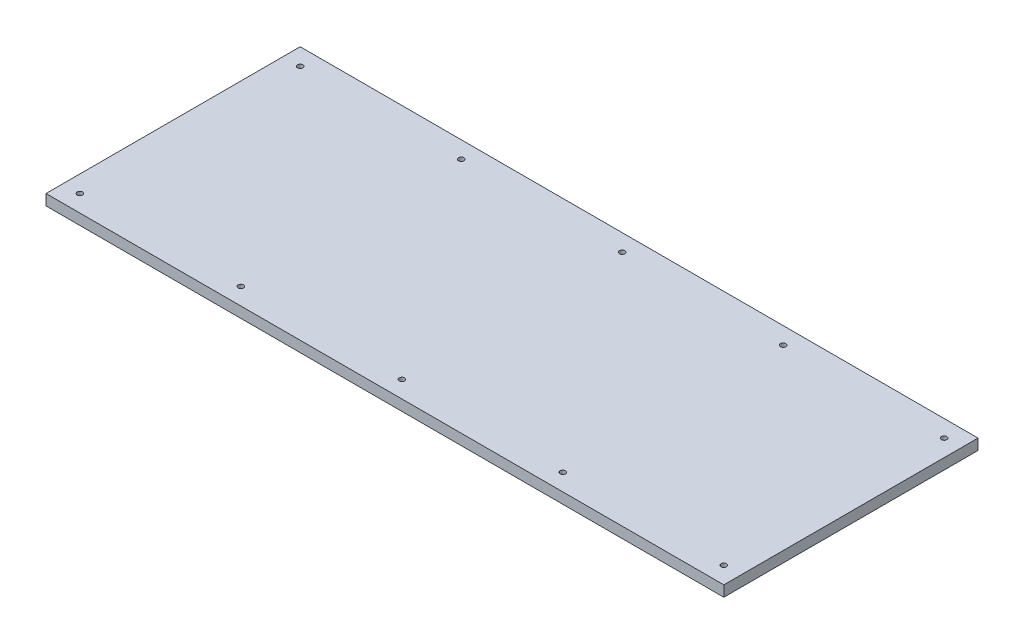
ISO-10303-21;
HEADER;
FILE_DESCRIPTION(('STEP AP214'),'2;1');
FILE_NAME('part.step','',(''),(''),'','','');
FILE_SCHEMA(('AUTOMOTIVE_DESIGN { 1 0 10303 214 1 1 1 1 }'));
ENDSEC;
DATA;
#1=APPLICATION_CONTEXT('core data for automotive mechanical design processes');
#2=APPLICATION_PROTOCOL_DEFINITION('international standard','automotive_design',2000,#1);
#3=PRODUCT_CONTEXT('',#1,'mechanical');
#4=PRODUCT('Part','Part','',(#3));
#5=PRODUCT_RELATED_PRODUCT_CATEGORY('part','',(#4));
#6=PRODUCT_DEFINITION_FORMATION('','',#4);
#7=PRODUCT_DEFINITION_CONTEXT('part definition',#1,'design');
#8=PRODUCT_DEFINITION('design','',#6,#7);
#9=PRODUCT_DEFINITION_SHAPE('','',#8);
#10=(LENGTH_UNIT() NAMED_UNIT(*) SI_UNIT(.MILLI.,.METRE.));
#11=(NAMED_UNIT(*) PLANE_ANGLE_UNIT() SI_UNIT($,.RADIAN.));
#12=(NAMED_UNIT(*) SI_UNIT($,.STERADIAN.) SOLID_ANGLE_UNIT());
#13=UNCERTAINTY_MEASURE_WITH_UNIT(LENGTH_MEASURE(1.E-05),#10,'distance_accuracy_value','');
#14=(GEOMETRIC_REPRESENTATION_CONTEXT(3) GLOBAL_UNCERTAINTY_ASSIGNED_CONTEXT((#13)) GLOBAL_UNIT_ASSIGNED_CONTEXT((#10,
#11,#12)) REPRESENTATION_CONTEXT('',''));
#15=CARTESIAN_POINT('',(0.,0.,0.));
#16=DIRECTION('',(0.,0.,1.));
#17=DIRECTION('',(1.,0.,0.));
#18=AXIS2_PLACEMENT_3D('',#15,#16,#17);
#19=CARTESIAN_POINT('',(190.,-6.35,65.));
#20=DIRECTION('',(0.,-1.,0.));
#21=DIRECTION('',(0.,0.,-1.));
#22=AXIS2_PLACEMENT_3D('',#19,#20,#21);
#23=CYLINDRICAL_SURFACE('',#22,1.59999999999999);
#24=CARTESIAN_POINT('',(190.,0.,65.));
#25=DIRECTION('',(0.,-1.,0.));
#26=DIRECTION('',(0.,0.,-1.));
#27=AXIS2_PLACEMENT_3D('',#24,#25,#26);
#28=CIRCLE('',#27,1.59999999999999);
#29=CARTESIAN_POINT('',(190.,0.,63.4));
#30=VERTEX_POINT('',#29);
#31=EDGE_CURVE('E42',#30,#30,#28,.T.);
#32=ORIENTED_EDGE('',*,*,#31,.F.);
#33=EDGE_LOOP('',(#32));
#34=FACE_BOUND('',#33,.T.);
#35=CARTESIAN_POINT('',(190.,-6.35,65.));
#36=DIRECTION('',(0.,-1.,0.));
#37=DIRECTION('',(0.,0.,-1.));
#38=AXIS2_PLACEMENT_3D('',#35,#36,#37);
#39=CIRCLE('',#38,1.59999999999999);
#40=CARTESIAN_POINT('',(190.,-6.35,63.4));
#41=VERTEX_POINT('',#40);
#42=EDGE_CURVE('E11',#41,#41,#39,.T.);
#43=ORIENTED_EDGE('',*,*,#42,.T.);
#44=EDGE_LOOP('',(#43));
#45=FACE_BOUND('',#44,.T.);
#46=ADVANCED_FACE('F34',(#34,#45),#23,.F.);
#47=CARTESIAN_POINT('',(95.0000000000001,-6.35,65.));
#48=DIRECTION('',(0.,-1.,0.));
#49=DIRECTION('',(0.,0.,-1.));
#50=AXIS2_PLACEMENT_3D('',#47,#48,#49);
#51=CYLINDRICAL_SURFACE('',#50,1.59999999999999);
#52=CARTESIAN_POINT('',(95.0000000000001,0.,65.));
#53=DIRECTION('',(0.,-1.,0.));
#54=DIRECTION('',(0.,0.,-1.));
#55=AXIS2_PLACEMENT_3D('',#52,#53,#54);
#56=CIRCLE('',#55,1.59999999999999);
#57=CARTESIAN_POINT('',(95.0000000000001,0.,63.4));
#58=VERTEX_POINT('',#57);
#59=EDGE_CURVE('E139',#58,#58,#56,.T.);
#60=ORIENTED_EDGE('',*,*,#59,.F.);
#61=EDGE_LOOP('',(#60));
#62=FACE_BOUND('',#61,.T.);
#63=CARTESIAN_POINT('',(95.0000000000001,-6.35,65.));
#64=DIRECTION('',(0.,-1.,0.));
#65=DIRECTION('',(0.,0.,-1.));
#66=AXIS2_PLACEMENT_3D('',#63,#64,#65);
#67=CIRCLE('',#66,1.59999999999999);
#68=CARTESIAN_POINT('',(95.0000000000001,-6.35,63.4));
#69=VERTEX_POINT('',#68);
#70=EDGE_CURVE('E142',#69,#69,#67,.T.);
#71=ORIENTED_EDGE('',*,*,#70,.T.);
#72=EDGE_LOOP('',(#71));
#73=FACE_BOUND('',#72,.T.);
#74=ADVANCED_FACE('F151',(#62,#73),#51,.F.);
#75=CARTESIAN_POINT('',(0.,-6.35,65.));
#76=DIRECTION('',(0.,-1.,0.));
#77=DIRECTION('',(0.,0.,-1.));
#78=AXIS2_PLACEMENT_3D('',#75,#76,#77);
#79=CYLINDRICAL_SURFACE('',#78,1.59999999999999);
#80=CARTESIAN_POINT('',(0.,0.,65.));
#81=DIRECTION('',(0.,-1.,0.));
#82=DIRECTION('',(0.,0.,-1.));
#83=AXIS2_PLACEMENT_3D('',#80,#81,#82);
#84=CIRCLE('',#83,1.59999999999999);
#85=CARTESIAN_POINT('',(0.,0.,63.4));
#86=VERTEX_POINT('',#85);
#87=EDGE_CURVE('E133',#86,#86,#84,.T.);
#88=ORIENTED_EDGE('',*,*,#87,.F.);
#89=EDGE_LOOP('',(#88));
#90=FACE_BOUND('',#89,.T.);
#91=CARTESIAN_POINT('',(0.,-6.35,65.));
#92=DIRECTION('',(0.,-1.,0.));
#93=DIRECTION('',(0.,0.,-1.));
#94=AXIS2_PLACEMENT_3D('',#91,#92,#93);
#95=CIRCLE('',#94,1.59999999999999);
#96=CARTESIAN_POINT('',(0.,-6.35,63.4));
#97=VERTEX_POINT('',#96);
#98=EDGE_CURVE('E136',#97,#97,#95,.T.);
#99=ORIENTED_EDGE('',*,*,#98,.T.);
#100=EDGE_LOOP('',(#99));
#101=FACE_BOUND('',#100,.T.);
#102=ADVANCED_FACE('F189',(#90,#101),#79,.F.);
#103=CARTESIAN_POINT('',(190.,-6.35,-65.));
#104=DIRECTION('',(0.,-1.,0.));
#105=DIRECTION('',(0.,0.,-1.));
#106=AXIS2_PLACEMENT_3D('',#103,#104,#105);
#107=CYLINDRICAL_SURFACE('',#106,1.59999999999999);
#108=CARTESIAN_POINT('',(190.,0.,-65.));
#109=DIRECTION('',(0.,-1.,0.));
#110=DIRECTION('',(0.,0.,-1.));
#111=AXIS2_PLACEMENT_3D('',#108,#109,#110);
#112=CIRCLE('',#111,1.59999999999999);
#113=CARTESIAN_POINT('',(190.,0.,-66.6));
#114=VERTEX_POINT('',#113);
#115=EDGE_CURVE('E127',#114,#114,#112,.T.);
#116=ORIENTED_EDGE('',*,*,#115,.F.);
#117=EDGE_LOOP('',(#116));
#118=FACE_BOUND('',#117,.T.);
#119=CARTESIAN_POINT('',(190.,-6.35,-65.));
#120=DIRECTION('',(0.,-1.,0.));
#121=DIRECTION('',(0.,0.,-1.));
#122=AXIS2_PLACEMENT_3D('',#119,#120,#121);
#123=CIRCLE('',#122,1.59999999999999);
#124=CARTESIAN_POINT('',(190.,-6.35,-66.6));
#125=VERTEX_POINT('',#124);
#126=EDGE_CURVE('E130',#125,#125,#123,.T.);
#127=ORIENTED_EDGE('',*,*,#126,.T.);
#128=EDGE_LOOP('',(#127));
#129=FACE_BOUND('',#128,.T.);
#130=ADVANCED_FACE('F185',(#118,#129),#107,.F.);
#131=CARTESIAN_POINT('',(95.0000000000001,-6.35,-65.));
#132=DIRECTION('',(0.,-1.,0.));
#133=DIRECTION('',(0.,0.,-1.));
#134=AXIS2_PLACEMENT_3D('',#131,#132,#133);
#135=CYLINDRICAL_SURFACE('',#134,1.59999999999999);
#136=CARTESIAN_POINT('',(95.0000000000001,0.,-65.));
#137=DIRECTION('',(0.,-1.,0.));
#138=DIRECTION('',(0.,0.,-1.));
#139=AXIS2_PLACEMENT_3D('',#136,#137,#138);
#140=CIRCLE('',#139,1.59999999999999);
#141=CARTESIAN_POINT('',(95.0000000000001,0.,-66.6));
#142=VERTEX_POINT('',#141);
#143=EDGE_CURVE('E121',#142,#142,#140,.T.);
#144=ORIENTED_EDGE('',*,*,#143,.F.);
#145=EDGE_LOOP('',(#144));
#146=FACE_BOUND('',#145,.T.);
#147=CARTESIAN_POINT('',(95.0000000000001,-6.35,-65.));
#148=DIRECTION('',(0.,-1.,0.));
#149=DIRECTION('',(0.,0.,-1.));
#150=AXIS2_PLACEMENT_3D('',#147,#148,#149);
#151=CIRCLE('',#150,1.59999999999999);
#152=CARTESIAN_POINT('',(95.0000000000001,-6.35,-66.6));
#153=VERTEX_POINT('',#152);
#154=EDGE_CURVE('E124',#153,#153,#151,.T.);
#155=ORIENTED_EDGE('',*,*,#154,.T.);
#156=EDGE_LOOP('',(#155));
#157=FACE_BOUND('',#156,.T.);
#158=ADVANCED_FACE('F181',(#146,#157),#135,.F.);
#159=CARTESIAN_POINT('',(0.,-6.35,-65.));
#160=DIRECTION('',(0.,-1.,0.));
#161=DIRECTION('',(0.,0.,-1.));
#162=AXIS2_PLACEMENT_3D('',#159,#160,#161);
#163=CYLINDRICAL_SURFACE('',#162,1.59999999999999);
#164=CARTESIAN_POINT('',(0.,0.,-65.));
#165=DIRECTION('',(0.,-1.,0.));
#166=DIRECTION('',(0.,0.,-1.));
#167=AXIS2_PLACEMENT_3D('',#164,#165,#166);
#168=CIRCLE('',#167,1.59999999999999);
#169=CARTESIAN_POINT('',(0.,0.,-66.6));
#170=VERTEX_POINT('',#169);
#171=EDGE_CURVE('E113',#170,#170,#168,.T.);
#172=ORIENTED_EDGE('',*,*,#171,.F.);
#173=EDGE_LOOP('',(#172));
#174=FACE_BOUND('',#173,.T.);
#175=CARTESIAN_POINT('',(0.,-6.35,-65.));
#176=DIRECTION('',(0.,-1.,0.));
#177=DIRECTION('',(0.,0.,-1.));
#178=AXIS2_PLACEMENT_3D('',#175,#176,#177);
#179=CIRCLE('',#178,1.59999999999999);
#180=CARTESIAN_POINT('',(0.,-6.35,-66.6));
#181=VERTEX_POINT('',#180);
#182=EDGE_CURVE('E118',#181,#181,#179,.T.);
#183=ORIENTED_EDGE('',*,*,#182,.T.);
#184=EDGE_LOOP('',(#183));
#185=FACE_BOUND('',#184,.T.);
#186=ADVANCED_FACE('F178',(#174,#185),#163,.F.);
#187=CARTESIAN_POINT('',(0.,-6.35,75.));
#188=DIRECTION('',(0.,0.,1.));
#189=DIRECTION('',(1.,0.,0.));
#190=AXIS2_PLACEMENT_3D('',#187,#188,#189);
#191=PLANE('',#190);
#192=DIRECTION('',(1.,0.,0.));
#193=VECTOR('',#192,1.);
#194=CARTESIAN_POINT('',(0.,0.,75.));
#195=LINE('',#194,#193);
#196=CARTESIAN_POINT('',(-200.,0.,75.));
#197=VERTEX_POINT('',#196);
#198=CARTESIAN_POINT('',(200.,0.,75.));
#199=VERTEX_POINT('',#198);
#200=EDGE_CURVE('E104',#197,#199,#195,.T.);
#201=ORIENTED_EDGE('',*,*,#200,.F.);
#202=DIRECTION('',(0.,1.,0.));
#203=VECTOR('',#202,1.);
#204=CARTESIAN_POINT('',(-200.,-6.35,75.));
#205=LINE('',#204,#203);
#206=CARTESIAN_POINT('',(-200.,-6.35,75.));
#207=VERTEX_POINT('',#206);
#208=EDGE_CURVE('E50',#207,#197,#205,.T.);
#209=ORIENTED_EDGE('',*,*,#208,.F.);
#210=DIRECTION('',(1.,0.,0.));
#211=VECTOR('',#210,1.);
#212=CARTESIAN_POINT('',(0.,-6.35,75.));
#213=LINE('',#212,#211);
#214=CARTESIAN_POINT('',(200.,-6.35,75.));
#215=VERTEX_POINT('',#214);
#216=EDGE_CURVE('E98',#207,#215,#213,.T.);
#217=ORIENTED_EDGE('',*,*,#216,.T.);
#218=DIRECTION('',(0.,1.,0.));
#219=VECTOR('',#218,1.);
#220=CARTESIAN_POINT('',(200.,-6.35,75.));
#221=LINE('',#220,#219);
#222=EDGE_CURVE('E75',#215,#199,#221,.T.);
#223=ORIENTED_EDGE('',*,*,#222,.T.);
#224=EDGE_LOOP('',(#201,#209,#217,#223));
#225=FACE_BOUND('',#224,.T.);
#226=ADVANCED_FACE('F173',(#225),#191,.T.);
#227=CARTESIAN_POINT('',(-200.,-6.35,0.));
#228=DIRECTION('',(1.,0.,0.));
#229=DIRECTION('',(0.,0.,-1.));
#230=AXIS2_PLACEMENT_3D('',#227,#228,#229);
#231=PLANE('',#230);
#232=DIRECTION('',(0.,0.,-1.));
#233=VECTOR('',#232,1.);
#234=CARTESIAN_POINT('',(-200.,0.,0.));
#235=LINE('',#234,#233);
#236=CARTESIAN_POINT('',(-200.,0.,-75.));
#237=VERTEX_POINT('',#236);
#238=EDGE_CURVE('E67',#197,#237,#235,.T.);
#239=ORIENTED_EDGE('',*,*,#238,.T.);
#240=DIRECTION('',(0.,1.,0.));
#241=VECTOR('',#240,1.);
#242=CARTESIAN_POINT('',(-200.,-6.35,-75.));
#243=LINE('',#242,#241);
#244=CARTESIAN_POINT('',(-200.,-6.35,-75.));
#245=VERTEX_POINT('',#244);
#246=EDGE_CURVE('E95',#245,#237,#243,.T.);
#247=ORIENTED_EDGE('',*,*,#246,.F.);
#248=DIRECTION('',(0.,0.,-1.));
#249=VECTOR('',#248,1.);
#250=CARTESIAN_POINT('',(-200.,-6.35,0.));
#251=LINE('',#250,#249);
#252=EDGE_CURVE('E86',#207,#245,#251,.T.);
#253=ORIENTED_EDGE('',*,*,#252,.F.);
#254=ORIENTED_EDGE('',*,*,#208,.T.);
#255=EDGE_LOOP('',(#239,#247,#253,#254));
#256=FACE_BOUND('',#255,.T.);
#257=ADVANCED_FACE('F170',(#256),#231,.F.);
#258=CARTESIAN_POINT('',(0.,-6.35,-75.));
#259=DIRECTION('',(0.,0.,1.));
#260=DIRECTION('',(1.,0.,0.));
#261=AXIS2_PLACEMENT_3D('',#258,#259,#260);
#262=PLANE('',#261);
#263=DIRECTION('',(1.,0.,0.));
#264=VECTOR('',#263,1.);
#265=CARTESIAN_POINT('',(0.,0.,-75.));
#266=LINE('',#265,#264);
#267=CARTESIAN_POINT('',(200.,0.,-75.));
#268=VERTEX_POINT('',#267);
#269=EDGE_CURVE('E93',#237,#268,#266,.T.);
#270=ORIENTED_EDGE('',*,*,#269,.T.);
#271=DIRECTION('',(0.,1.,0.));
#272=VECTOR('',#271,1.);
#273=CARTESIAN_POINT('',(200.,-6.35,-75.));
#274=LINE('',#273,#272);
#275=CARTESIAN_POINT('',(200.,-6.35,-75.));
#276=VERTEX_POINT('',#275);
#277=EDGE_CURVE('E90',#276,#268,#274,.T.);
#278=ORIENTED_EDGE('',*,*,#277,.F.);
#279=DIRECTION('',(1.,0.,0.));
#280=VECTOR('',#279,1.);
#281=CARTESIAN_POINT('',(0.,-6.35,-75.));
#282=LINE('',#281,#280);
#283=EDGE_CURVE('E80',#245,#276,#282,.T.);
#284=ORIENTED_EDGE('',*,*,#283,.F.);
#285=ORIENTED_EDGE('',*,*,#246,.T.);
#286=EDGE_LOOP('',(#270,#278,#284,#285));
#287=FACE_BOUND('',#286,.T.);
#288=ADVANCED_FACE('F91',(#287),#262,.F.);
#289=CARTESIAN_POINT('',(200.,-6.35,0.));
#290=DIRECTION('',(1.,0.,0.));
#291=DIRECTION('',(0.,0.,-1.));
#292=AXIS2_PLACEMENT_3D('',#289,#290,#291);
#293=PLANE('',#292);
#294=DIRECTION('',(0.,0.,-1.));
#295=VECTOR('',#294,1.);
#296=CARTESIAN_POINT('',(200.,0.,0.));
#297=LINE('',#296,#295);
#298=EDGE_CURVE('E107',#199,#268,#297,.T.);
#299=ORIENTED_EDGE('',*,*,#298,.F.);
#300=ORIENTED_EDGE('',*,*,#222,.F.);
#301=DIRECTION('',(0.,0.,-1.));
#302=VECTOR('',#301,1.);
#303=CARTESIAN_POINT('',(200.,-6.35,0.));
#304=LINE('',#303,#302);
#305=EDGE_CURVE('E85',#215,#276,#304,.T.);
#306=ORIENTED_EDGE('',*,*,#305,.T.);
#307=ORIENTED_EDGE('',*,*,#277,.T.);
#308=EDGE_LOOP('',(#299,#300,#306,#307));
#309=FACE_BOUND('',#308,.T.);
#310=ADVANCED_FACE('F97',(#309),#293,.T.);
#311=CARTESIAN_POINT('',(0.,-6.35,0.));
#312=DIRECTION('',(0.,1.,0.));
#313=DIRECTION('',(0.,0.,1.));
#314=AXIS2_PLACEMENT_3D('',#311,#312,#313);
#315=PLANE('',#314);
#316=CARTESIAN_POINT('',(-95.,-6.35,65.));
#317=DIRECTION('',(0.,-1.,0.));
#318=DIRECTION('',(0.,0.,-1.));
#319=AXIS2_PLACEMENT_3D('',#316,#317,#318);
#320=CIRCLE('',#319,1.59999999999999);
#321=CARTESIAN_POINT('',(-95.,-6.35,63.4));
#322=VERTEX_POINT('',#321);
#323=EDGE_CURVE('E299',#322,#322,#320,.T.);
#324=ORIENTED_EDGE('',*,*,#323,.F.);
#325=EDGE_LOOP('',(#324));
#326=FACE_BOUND('',#325,.T.);
#327=CARTESIAN_POINT('',(-95.,-6.35,-65.));
#328=DIRECTION('',(0.,-1.,0.));
#329=DIRECTION('',(0.,0.,-1.));
#330=AXIS2_PLACEMENT_3D('',#327,#328,#329);
#331=CIRCLE('',#330,1.59999999999999);
#332=CARTESIAN_POINT('',(-95.,-6.35,-66.6));
#333=VERTEX_POINT('',#332);
#334=EDGE_CURVE('E303',#333,#333,#331,.T.);
#335=ORIENTED_EDGE('',*,*,#334,.F.);
#336=EDGE_LOOP('',(#335));
#337=FACE_BOUND('',#336,.T.);
#338=CARTESIAN_POINT('',(-190.,-6.35,-65.));
#339=DIRECTION('',(0.,-1.,0.));
#340=DIRECTION('',(0.,0.,-1.));
#341=AXIS2_PLACEMENT_3D('',#338,#339,#340);
#342=CIRCLE('',#341,1.59999999999999);
#343=CARTESIAN_POINT('',(-190.,-6.35,-66.6));
#344=VERTEX_POINT('',#343);
#345=EDGE_CURVE('E309',#344,#344,#342,.T.);
#346=ORIENTED_EDGE('',*,*,#345,.F.);
#347=EDGE_LOOP('',(#346));
#348=FACE_BOUND('',#347,.T.);
#349=CARTESIAN_POINT('',(-190.,-6.35,65.));
#350=DIRECTION('',(0.,-1.,0.));
#351=DIRECTION('',(0.,0.,-1.));
#352=AXIS2_PLACEMENT_3D('',#349,#350,#351);
#353=CIRCLE('',#352,1.59999999999999);
#354=CARTESIAN_POINT('',(-190.,-6.35,63.4));
#355=VERTEX_POINT('',#354);
#356=EDGE_CURVE('E315',#355,#355,#353,.T.);
#357=ORIENTED_EDGE('',*,*,#356,.F.);
#358=EDGE_LOOP('',(#357));
#359=FACE_BOUND('',#358,.T.);
#360=ORIENTED_EDGE('',*,*,#216,.F.);
#361=ORIENTED_EDGE('',*,*,#252,.T.);
#362=ORIENTED_EDGE('',*,*,#283,.T.);
#363=ORIENTED_EDGE('',*,*,#305,.F.);
#364=EDGE_LOOP('',(#360,#361,#362,#363));
#365=FACE_BOUND('',#364,.T.);
#366=ORIENTED_EDGE('',*,*,#182,.F.);
#367=EDGE_LOOP('',(#366));
#368=FACE_BOUND('',#367,.T.);
#369=ORIENTED_EDGE('',*,*,#154,.F.);
#370=EDGE_LOOP('',(#369));
#371=FACE_BOUND('',#370,.T.);
#372=ORIENTED_EDGE('',*,*,#126,.F.);
#373=EDGE_LOOP('',(#372));
#374=FACE_BOUND('',#373,.T.);
#375=ORIENTED_EDGE('',*,*,#98,.F.);
#376=EDGE_LOOP('',(#375));
#377=FACE_BOUND('',#376,.T.);
#378=ORIENTED_EDGE('',*,*,#70,.F.);
#379=EDGE_LOOP('',(#378));
#380=FACE_BOUND('',#379,.T.);
#381=ORIENTED_EDGE('',*,*,#42,.F.);
#382=EDGE_LOOP('',(#381));
#383=FACE_BOUND('',#382,.T.);
#384=ADVANCED_FACE('F83',(#326,#337,#348,#359,#365,#368,#371,#374,#377,#380,#383),#315,.F.);
#385=CARTESIAN_POINT('',(0.,0.,0.));
#386=DIRECTION('',(0.,1.,0.));
#387=DIRECTION('',(0.,0.,1.));
#388=AXIS2_PLACEMENT_3D('',#385,#386,#387);
#389=PLANE('',#388);
#390=CARTESIAN_POINT('',(-95.,0.,65.));
#391=DIRECTION('',(0.,-1.,0.));
#392=DIRECTION('',(0.,0.,-1.));
#393=AXIS2_PLACEMENT_3D('',#390,#391,#392);
#394=CIRCLE('',#393,1.59999999999999);
#395=CARTESIAN_POINT('',(-95.,0.,63.4));
#396=VERTEX_POINT('',#395);
#397=EDGE_CURVE('E297',#396,#396,#394,.T.);
#398=ORIENTED_EDGE('',*,*,#397,.T.);
#399=EDGE_LOOP('',(#398));
#400=FACE_BOUND('',#399,.T.);
#401=CARTESIAN_POINT('',(-95.,0.,-65.));
#402=DIRECTION('',(0.,-1.,0.));
#403=DIRECTION('',(0.,0.,-1.));
#404=AXIS2_PLACEMENT_3D('',#401,#402,#403);
#405=CIRCLE('',#404,1.59999999999999);
#406=CARTESIAN_POINT('',(-95.,0.,-66.6));
#407=VERTEX_POINT('',#406);
#408=EDGE_CURVE('E300',#407,#407,#405,.T.);
#409=ORIENTED_EDGE('',*,*,#408,.T.);
#410=EDGE_LOOP('',(#409));
#411=FACE_BOUND('',#410,.T.);
#412=CARTESIAN_POINT('',(-190.,0.,-65.));
#413=DIRECTION('',(0.,-1.,0.));
#414=DIRECTION('',(0.,0.,-1.));
#415=AXIS2_PLACEMENT_3D('',#412,#413,#414);
#416=CIRCLE('',#415,1.59999999999999);
#417=CARTESIAN_POINT('',(-190.,0.,-66.6));
#418=VERTEX_POINT('',#417);
#419=EDGE_CURVE('E312',#418,#418,#416,.T.);
#420=ORIENTED_EDGE('',*,*,#419,.T.);
#421=EDGE_LOOP('',(#420));
#422=FACE_BOUND('',#421,.T.);
#423=CARTESIAN_POINT('',(-190.,0.,65.));
#424=DIRECTION('',(0.,-1.,0.));
#425=DIRECTION('',(0.,0.,-1.));
#426=AXIS2_PLACEMENT_3D('',#423,#424,#425);
#427=CIRCLE('',#426,1.59999999999999);
#428=CARTESIAN_POINT('',(-190.,0.,63.4));
#429=VERTEX_POINT('',#428);
#430=EDGE_CURVE('E108',#429,#429,#427,.T.);
#431=ORIENTED_EDGE('',*,*,#430,.T.);
#432=EDGE_LOOP('',(#431));
#433=FACE_BOUND('',#432,.T.);
#434=ORIENTED_EDGE('',*,*,#200,.T.);
#435=ORIENTED_EDGE('',*,*,#298,.T.);
#436=ORIENTED_EDGE('',*,*,#269,.F.);
#437=ORIENTED_EDGE('',*,*,#238,.F.);
#438=EDGE_LOOP('',(#434,#435,#436,#437));
#439=FACE_BOUND('',#438,.T.);
#440=ORIENTED_EDGE('',*,*,#171,.T.);
#441=EDGE_LOOP('',(#440));
#442=FACE_BOUND('',#441,.T.);
#443=ORIENTED_EDGE('',*,*,#143,.T.);
#444=EDGE_LOOP('',(#443));
#445=FACE_BOUND('',#444,.T.);
#446=ORIENTED_EDGE('',*,*,#115,.T.);
#447=EDGE_LOOP('',(#446));
#448=FACE_BOUND('',#447,.T.);
#449=ORIENTED_EDGE('',*,*,#87,.T.);
#450=EDGE_LOOP('',(#449));
#451=FACE_BOUND('',#450,.T.);
#452=ORIENTED_EDGE('',*,*,#59,.T.);
#453=EDGE_LOOP('',(#452));
#454=FACE_BOUND('',#453,.T.);
#455=ORIENTED_EDGE('',*,*,#31,.T.);
#456=EDGE_LOOP('',(#455));
#457=FACE_BOUND('',#456,.T.);
#458=ADVANCED_FACE('F147',(#400,#411,#422,#433,#439,#442,#445,#448,#451,#454,#457),#389,.T.);
#459=CARTESIAN_POINT('',(-190.,-6.35,65.));
#460=DIRECTION('',(0.,-1.,0.));
#461=DIRECTION('',(0.,0.,-1.));
#462=AXIS2_PLACEMENT_3D('',#459,#460,#461);
#463=CYLINDRICAL_SURFACE('',#462,1.59999999999999);
#464=ORIENTED_EDGE('',*,*,#430,.F.);
#465=EDGE_LOOP('',(#464));
#466=FACE_BOUND('',#465,.T.);
#467=ORIENTED_EDGE('',*,*,#356,.T.);
#468=EDGE_LOOP('',(#467));
#469=FACE_BOUND('',#468,.T.);
#470=ADVANCED_FACE('F161',(#466,#469),#463,.F.);
#471=CARTESIAN_POINT('',(-190.,-6.35,-65.));
#472=DIRECTION('',(0.,-1.,0.));
#473=DIRECTION('',(0.,0.,-1.));
#474=AXIS2_PLACEMENT_3D('',#471,#472,#473);
#475=CYLINDRICAL_SURFACE('',#474,1.59999999999999);
#476=ORIENTED_EDGE('',*,*,#419,.F.);
#477=EDGE_LOOP('',(#476));
#478=FACE_BOUND('',#477,.T.);
#479=ORIENTED_EDGE('',*,*,#345,.T.);
#480=EDGE_LOOP('',(#479));
#481=FACE_BOUND('',#480,.T.);
#482=ADVANCED_FACE('F246',(#478,#481),#475,.F.);
#483=CARTESIAN_POINT('',(-95.,-6.35,-65.));
#484=DIRECTION('',(0.,-1.,0.));
#485=DIRECTION('',(0.,0.,-1.));
#486=AXIS2_PLACEMENT_3D('',#483,#484,#485);
#487=CYLINDRICAL_SURFACE('',#486,1.59999999999999);
#488=ORIENTED_EDGE('',*,*,#408,.F.);
#489=EDGE_LOOP('',(#488));
#490=FACE_BOUND('',#489,.T.);
#491=ORIENTED_EDGE('',*,*,#334,.T.);
#492=EDGE_LOOP('',(#491));
#493=FACE_BOUND('',#492,.T.);
#494=ADVANCED_FACE('F255',(#490,#493),#487,.F.);
#495=CARTESIAN_POINT('',(-95.,-6.35,65.));
#496=DIRECTION('',(0.,-1.,0.));
#497=DIRECTION('',(0.,0.,-1.));
#498=AXIS2_PLACEMENT_3D('',#495,#496,#497);
#499=CYLINDRICAL_SURFACE('',#498,1.59999999999999);
#500=ORIENTED_EDGE('',*,*,#397,.F.);
#501=EDGE_LOOP('',(#500));
#502=FACE_BOUND('',#501,.T.);
#503=ORIENTED_EDGE('',*,*,#323,.T.);
#504=EDGE_LOOP('',(#503));
#505=FACE_BOUND('',#504,.T.);
#506=ADVANCED_FACE('F280',(#502,#505),#499,.F.);
#507=CLOSED_SHELL('',(#46,#74,#102,#130,#158,#186,#226,#257,#288,#310,#384,#458,#470,#482,#494,#506));
#508=MANIFOLD_SOLID_BREP('B2',#507);
#509=ADVANCED_BREP_SHAPE_REPRESENTATION('',(#18,#508),#14);
#510=SHAPE_DEFINITION_REPRESENTATION(#9,#509);
ENDSEC;
END-ISO-10303-21;
